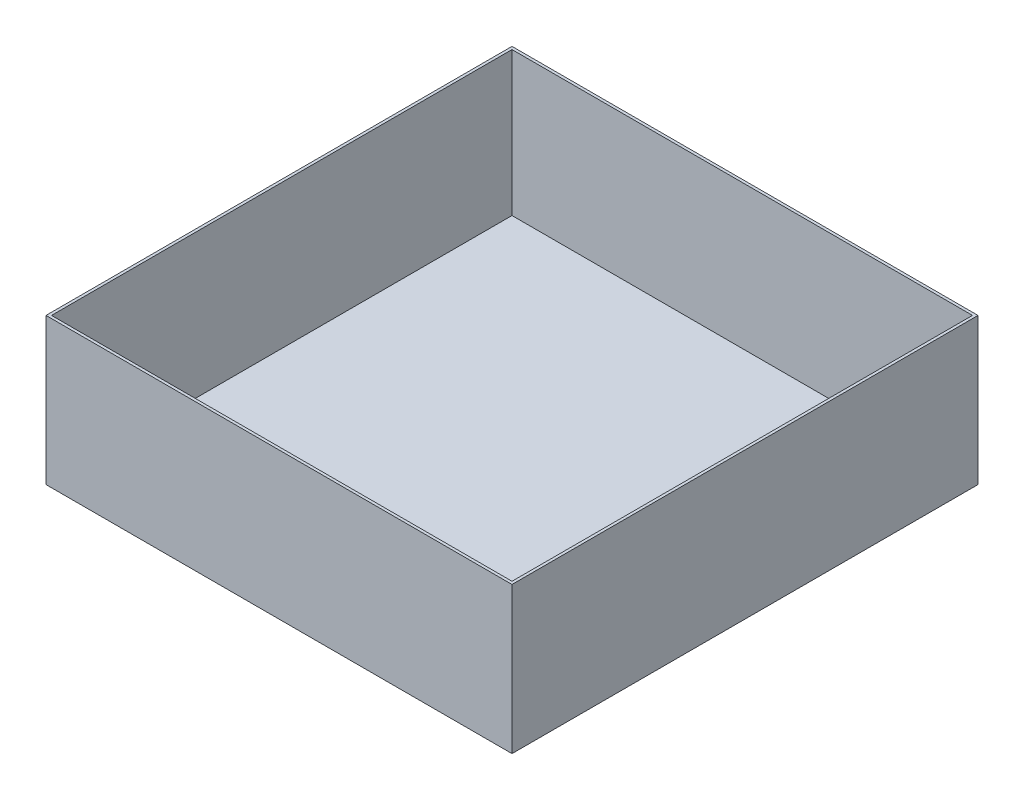
ISO-10303-21;
HEADER;
FILE_DESCRIPTION(('STEP AP214'),'2;1');
FILE_NAME('part.step','',(''),(''),'','','');
FILE_SCHEMA(('AUTOMOTIVE_DESIGN { 1 0 10303 214 1 1 1 1 }'));
ENDSEC;
DATA;
#1=APPLICATION_CONTEXT('core data for automotive mechanical design processes');
#2=APPLICATION_PROTOCOL_DEFINITION('international standard','automotive_design',2000,#1);
#3=PRODUCT_CONTEXT('',#1,'mechanical');
#4=PRODUCT('Part','Part','',(#3));
#5=PRODUCT_RELATED_PRODUCT_CATEGORY('part','',(#4));
#6=PRODUCT_DEFINITION_FORMATION('','',#4);
#7=PRODUCT_DEFINITION_CONTEXT('part definition',#1,'design');
#8=PRODUCT_DEFINITION('design','',#6,#7);
#9=PRODUCT_DEFINITION_SHAPE('','',#8);
#10=(LENGTH_UNIT() NAMED_UNIT(*) SI_UNIT(.MILLI.,.METRE.));
#11=(NAMED_UNIT(*) PLANE_ANGLE_UNIT() SI_UNIT($,.RADIAN.));
#12=(NAMED_UNIT(*) SI_UNIT($,.STERADIAN.) SOLID_ANGLE_UNIT());
#13=UNCERTAINTY_MEASURE_WITH_UNIT(LENGTH_MEASURE(1.E-05),#10,'distance_accuracy_value','');
#14=(GEOMETRIC_REPRESENTATION_CONTEXT(3) GLOBAL_UNCERTAINTY_ASSIGNED_CONTEXT((#13)) GLOBAL_UNIT_ASSIGNED_CONTEXT((#10,
#11,#12)) REPRESENTATION_CONTEXT('',''));
#15=CARTESIAN_POINT('',(0.,0.,0.));
#16=DIRECTION('',(0.,0.,1.));
#17=DIRECTION('',(1.,0.,0.));
#18=AXIS2_PLACEMENT_3D('',#15,#16,#17);
#19=CARTESIAN_POINT('',(0.,10.,0.));
#20=DIRECTION('',(0.,-1.,0.));
#21=DIRECTION('',(0.,0.,-1.));
#22=AXIS2_PLACEMENT_3D('',#19,#20,#21);
#23=PLANE('',#22);
#24=DIRECTION('',(0.,0.,-1.));
#25=VECTOR('',#24,1.);
#26=CARTESIAN_POINT('',(838.2,10.,838.2));
#27=LINE('',#26,#25);
#28=CARTESIAN_POINT('',(838.2,10.,838.2));
#29=VERTEX_POINT('',#28);
#30=CARTESIAN_POINT('',(838.2,10.,-838.2));
#31=VERTEX_POINT('',#30);
#32=EDGE_CURVE('E211',#29,#31,#27,.T.);
#33=ORIENTED_EDGE('',*,*,#32,.T.);
#34=DIRECTION('',(-1.,0.,0.));
#35=VECTOR('',#34,1.);
#36=CARTESIAN_POINT('',(-838.2,10.,-838.2));
#37=LINE('',#36,#35);
#38=CARTESIAN_POINT('',(-838.2,10.,-838.2));
#39=VERTEX_POINT('',#38);
#40=EDGE_CURVE('E91',#31,#39,#37,.T.);
#41=ORIENTED_EDGE('',*,*,#40,.T.);
#42=DIRECTION('',(0.,0.,1.));
#43=VECTOR('',#42,1.);
#44=CARTESIAN_POINT('',(-838.2,10.,838.2));
#45=LINE('',#44,#43);
#46=CARTESIAN_POINT('',(-838.2,10.,838.2));
#47=VERTEX_POINT('',#46);
#48=EDGE_CURVE('E76',#39,#47,#45,.T.);
#49=ORIENTED_EDGE('',*,*,#48,.T.);
#50=DIRECTION('',(1.,0.,0.));
#51=VECTOR('',#50,1.);
#52=CARTESIAN_POINT('',(-838.2,10.,838.2));
#53=LINE('',#52,#51);
#54=EDGE_CURVE('E12',#47,#29,#53,.T.);
#55=ORIENTED_EDGE('',*,*,#54,.T.);
#56=EDGE_LOOP('',(#33,#41,#49,#55));
#57=FACE_BOUND('',#56,.T.);
#58=ADVANCED_FACE('F67',(#57),#23,.F.);
#59=CARTESIAN_POINT('',(838.2,533.4,838.2));
#60=DIRECTION('',(-1.,0.,0.));
#61=DIRECTION('',(0.,0.,1.));
#62=AXIS2_PLACEMENT_3D('',#59,#60,#61);
#63=PLANE('',#62);
#64=ORIENTED_EDGE('',*,*,#32,.F.);
#65=DIRECTION('',(0.,-1.,0.));
#66=VECTOR('',#65,1.);
#67=CARTESIAN_POINT('',(838.2,533.4,838.2));
#68=LINE('',#67,#66);
#69=CARTESIAN_POINT('',(838.2,533.4,838.2));
#70=VERTEX_POINT('',#69);
#71=EDGE_CURVE('E83',#70,#29,#68,.T.);
#72=ORIENTED_EDGE('',*,*,#71,.F.);
#73=DIRECTION('',(0.,0.,-1.));
#74=VECTOR('',#73,1.);
#75=CARTESIAN_POINT('',(838.2,533.4,838.2));
#76=LINE('',#75,#74);
#77=CARTESIAN_POINT('',(838.2,533.4,-838.2));
#78=VERTEX_POINT('',#77);
#79=EDGE_CURVE('E134',#70,#78,#76,.T.);
#80=ORIENTED_EDGE('',*,*,#79,.T.);
#81=DIRECTION('',(0.,-1.,0.));
#82=VECTOR('',#81,1.);
#83=CARTESIAN_POINT('',(838.2,533.4,-838.2));
#84=LINE('',#83,#82);
#85=EDGE_CURVE('E136',#78,#31,#84,.T.);
#86=ORIENTED_EDGE('',*,*,#85,.T.);
#87=EDGE_LOOP('',(#64,#72,#80,#86));
#88=FACE_BOUND('',#87,.T.);
#89=ADVANCED_FACE('F135',(#88),#63,.T.);
#90=CARTESIAN_POINT('',(-838.2,533.4,-838.2));
#91=DIRECTION('',(0.,0.,1.));
#92=DIRECTION('',(1.,0.,0.));
#93=AXIS2_PLACEMENT_3D('',#90,#91,#92);
#94=PLANE('',#93);
#95=ORIENTED_EDGE('',*,*,#40,.F.);
#96=ORIENTED_EDGE('',*,*,#85,.F.);
#97=DIRECTION('',(-1.,0.,0.));
#98=VECTOR('',#97,1.);
#99=CARTESIAN_POINT('',(-838.2,533.4,-838.2));
#100=LINE('',#99,#98);
#101=CARTESIAN_POINT('',(-838.2,533.4,-838.2));
#102=VERTEX_POINT('',#101);
#103=EDGE_CURVE('E142',#78,#102,#100,.T.);
#104=ORIENTED_EDGE('',*,*,#103,.T.);
#105=DIRECTION('',(0.,-1.,0.));
#106=VECTOR('',#105,1.);
#107=CARTESIAN_POINT('',(-838.2,533.4,-838.2));
#108=LINE('',#107,#106);
#109=EDGE_CURVE('E148',#102,#39,#108,.T.);
#110=ORIENTED_EDGE('',*,*,#109,.T.);
#111=EDGE_LOOP('',(#95,#96,#104,#110));
#112=FACE_BOUND('',#111,.T.);
#113=ADVANCED_FACE('F144',(#112),#94,.T.);
#114=CARTESIAN_POINT('',(-838.2,533.4,838.2));
#115=DIRECTION('',(1.,0.,0.));
#116=DIRECTION('',(0.,0.,-1.));
#117=AXIS2_PLACEMENT_3D('',#114,#115,#116);
#118=PLANE('',#117);
#119=ORIENTED_EDGE('',*,*,#48,.F.);
#120=ORIENTED_EDGE('',*,*,#109,.F.);
#121=DIRECTION('',(0.,0.,1.));
#122=VECTOR('',#121,1.);
#123=CARTESIAN_POINT('',(-838.2,533.4,838.2));
#124=LINE('',#123,#122);
#125=CARTESIAN_POINT('',(-838.2,533.4,838.2));
#126=VERTEX_POINT('',#125);
#127=EDGE_CURVE('E153',#102,#126,#124,.T.);
#128=ORIENTED_EDGE('',*,*,#127,.T.);
#129=DIRECTION('',(0.,-1.,0.));
#130=VECTOR('',#129,1.);
#131=CARTESIAN_POINT('',(-838.2,533.4,838.2));
#132=LINE('',#131,#130);
#133=EDGE_CURVE('E164',#126,#47,#132,.T.);
#134=ORIENTED_EDGE('',*,*,#133,.T.);
#135=EDGE_LOOP('',(#119,#120,#128,#134));
#136=FACE_BOUND('',#135,.T.);
#137=ADVANCED_FACE('F219',(#136),#118,.T.);
#138=CARTESIAN_POINT('',(-838.2,533.4,838.2));
#139=DIRECTION('',(0.,0.,-1.));
#140=DIRECTION('',(-1.,0.,0.));
#141=AXIS2_PLACEMENT_3D('',#138,#139,#140);
#142=PLANE('',#141);
#143=ORIENTED_EDGE('',*,*,#54,.F.);
#144=ORIENTED_EDGE('',*,*,#133,.F.);
#145=DIRECTION('',(1.,0.,0.));
#146=VECTOR('',#145,1.);
#147=CARTESIAN_POINT('',(-838.2,533.4,838.2));
#148=LINE('',#147,#146);
#149=EDGE_CURVE('E157',#126,#70,#148,.T.);
#150=ORIENTED_EDGE('',*,*,#149,.T.);
#151=ORIENTED_EDGE('',*,*,#71,.T.);
#152=EDGE_LOOP('',(#143,#144,#150,#151));
#153=FACE_BOUND('',#152,.T.);
#154=ADVANCED_FACE('F220',(#153),#142,.T.);
#155=CARTESIAN_POINT('',(0.,533.4,0.));
#156=DIRECTION('',(0.,1.,0.));
#157=DIRECTION('',(0.,0.,1.));
#158=AXIS2_PLACEMENT_3D('',#155,#156,#157);
#159=PLANE('',#158);
#160=DIRECTION('',(0.,0.,-1.));
#161=VECTOR('',#160,1.);
#162=CARTESIAN_POINT('',(848.2,533.4,0.));
#163=LINE('',#162,#161);
#164=CARTESIAN_POINT('',(848.2,533.4,848.2));
#165=VERTEX_POINT('',#164);
#166=CARTESIAN_POINT('',(848.2,533.4,-848.2));
#167=VERTEX_POINT('',#166);
#168=EDGE_CURVE('E170',#165,#167,#163,.T.);
#169=ORIENTED_EDGE('',*,*,#168,.T.);
#170=DIRECTION('',(-1.,0.,0.));
#171=VECTOR('',#170,1.);
#172=CARTESIAN_POINT('',(0.,533.4,-848.2));
#173=LINE('',#172,#171);
#174=CARTESIAN_POINT('',(-848.2,533.4,-848.2));
#175=VERTEX_POINT('',#174);
#176=EDGE_CURVE('E174',#167,#175,#173,.T.);
#177=ORIENTED_EDGE('',*,*,#176,.T.);
#178=DIRECTION('',(0.,0.,1.));
#179=VECTOR('',#178,1.);
#180=CARTESIAN_POINT('',(-848.2,533.4,0.));
#181=LINE('',#180,#179);
#182=CARTESIAN_POINT('',(-848.2,533.4,848.2));
#183=VERTEX_POINT('',#182);
#184=EDGE_CURVE('E178',#175,#183,#181,.T.);
#185=ORIENTED_EDGE('',*,*,#184,.T.);
#186=DIRECTION('',(1.,0.,0.));
#187=VECTOR('',#186,1.);
#188=CARTESIAN_POINT('',(0.,533.4,848.2));
#189=LINE('',#188,#187);
#190=EDGE_CURVE('E181',#183,#165,#189,.T.);
#191=ORIENTED_EDGE('',*,*,#190,.T.);
#192=EDGE_LOOP('',(#169,#177,#185,#191));
#193=FACE_BOUND('',#192,.T.);
#194=ORIENTED_EDGE('',*,*,#103,.F.);
#195=ORIENTED_EDGE('',*,*,#79,.F.);
#196=ORIENTED_EDGE('',*,*,#149,.F.);
#197=ORIENTED_EDGE('',*,*,#127,.F.);
#198=EDGE_LOOP('',(#194,#195,#196,#197));
#199=FACE_BOUND('',#198,.T.);
#200=ADVANCED_FACE('F151',(#193,#199),#159,.T.);
#201=CARTESIAN_POINT('',(848.2,533.4,0.));
#202=DIRECTION('',(-1.,0.,0.));
#203=DIRECTION('',(0.,0.,1.));
#204=AXIS2_PLACEMENT_3D('',#201,#202,#203);
#205=PLANE('',#204);
#206=DIRECTION('',(0.,0.,-1.));
#207=VECTOR('',#206,1.);
#208=CARTESIAN_POINT('',(848.2,0.,0.));
#209=LINE('',#208,#207);
#210=CARTESIAN_POINT('',(848.2,0.,848.2));
#211=VERTEX_POINT('',#210);
#212=CARTESIAN_POINT('',(848.2,0.,-848.2));
#213=VERTEX_POINT('',#212);
#214=EDGE_CURVE('E147',#211,#213,#209,.T.);
#215=ORIENTED_EDGE('',*,*,#214,.T.);
#216=DIRECTION('',(0.,-1.,0.));
#217=VECTOR('',#216,1.);
#218=CARTESIAN_POINT('',(848.2,533.4,-848.2));
#219=LINE('',#218,#217);
#220=EDGE_CURVE('E207',#167,#213,#219,.T.);
#221=ORIENTED_EDGE('',*,*,#220,.F.);
#222=ORIENTED_EDGE('',*,*,#168,.F.);
#223=DIRECTION('',(0.,-1.,0.));
#224=VECTOR('',#223,1.);
#225=CARTESIAN_POINT('',(848.2,533.4,848.2));
#226=LINE('',#225,#224);
#227=EDGE_CURVE('E184',#165,#211,#226,.T.);
#228=ORIENTED_EDGE('',*,*,#227,.T.);
#229=EDGE_LOOP('',(#215,#221,#222,#228));
#230=FACE_BOUND('',#229,.T.);
#231=ADVANCED_FACE('F227',(#230),#205,.F.);
#232=CARTESIAN_POINT('',(0.,533.4,-848.2));
#233=DIRECTION('',(0.,0.,1.));
#234=DIRECTION('',(1.,0.,0.));
#235=AXIS2_PLACEMENT_3D('',#232,#233,#234);
#236=PLANE('',#235);
#237=DIRECTION('',(-1.,0.,0.));
#238=VECTOR('',#237,1.);
#239=CARTESIAN_POINT('',(0.,0.,-848.2));
#240=LINE('',#239,#238);
#241=CARTESIAN_POINT('',(-848.2,0.,-848.2));
#242=VERTEX_POINT('',#241);
#243=EDGE_CURVE('E188',#213,#242,#240,.T.);
#244=ORIENTED_EDGE('',*,*,#243,.T.);
#245=DIRECTION('',(0.,-1.,0.));
#246=VECTOR('',#245,1.);
#247=CARTESIAN_POINT('',(-848.2,533.4,-848.2));
#248=LINE('',#247,#246);
#249=EDGE_CURVE('E203',#175,#242,#248,.T.);
#250=ORIENTED_EDGE('',*,*,#249,.F.);
#251=ORIENTED_EDGE('',*,*,#176,.F.);
#252=ORIENTED_EDGE('',*,*,#220,.T.);
#253=EDGE_LOOP('',(#244,#250,#251,#252));
#254=FACE_BOUND('',#253,.T.);
#255=ADVANCED_FACE('F239',(#254),#236,.F.);
#256=CARTESIAN_POINT('',(-848.2,533.4,0.));
#257=DIRECTION('',(1.,0.,0.));
#258=DIRECTION('',(0.,0.,-1.));
#259=AXIS2_PLACEMENT_3D('',#256,#257,#258);
#260=PLANE('',#259);
#261=DIRECTION('',(0.,0.,1.));
#262=VECTOR('',#261,1.);
#263=CARTESIAN_POINT('',(-848.2,0.,0.));
#264=LINE('',#263,#262);
#265=CARTESIAN_POINT('',(-848.2,0.,848.2));
#266=VERTEX_POINT('',#265);
#267=EDGE_CURVE('E191',#242,#266,#264,.T.);
#268=ORIENTED_EDGE('',*,*,#267,.T.);
#269=DIRECTION('',(0.,-1.,0.));
#270=VECTOR('',#269,1.);
#271=CARTESIAN_POINT('',(-848.2,533.4,848.2));
#272=LINE('',#271,#270);
#273=EDGE_CURVE('E199',#183,#266,#272,.T.);
#274=ORIENTED_EDGE('',*,*,#273,.F.);
#275=ORIENTED_EDGE('',*,*,#184,.F.);
#276=ORIENTED_EDGE('',*,*,#249,.T.);
#277=EDGE_LOOP('',(#268,#274,#275,#276));
#278=FACE_BOUND('',#277,.T.);
#279=ADVANCED_FACE('F243',(#278),#260,.F.);
#280=CARTESIAN_POINT('',(0.,533.4,848.2));
#281=DIRECTION('',(0.,0.,-1.));
#282=DIRECTION('',(-1.,0.,0.));
#283=AXIS2_PLACEMENT_3D('',#280,#281,#282);
#284=PLANE('',#283);
#285=DIRECTION('',(1.,0.,0.));
#286=VECTOR('',#285,1.);
#287=CARTESIAN_POINT('',(0.,0.,848.2));
#288=LINE('',#287,#286);
#289=EDGE_CURVE('E175',#266,#211,#288,.T.);
#290=ORIENTED_EDGE('',*,*,#289,.T.);
#291=ORIENTED_EDGE('',*,*,#227,.F.);
#292=ORIENTED_EDGE('',*,*,#190,.F.);
#293=ORIENTED_EDGE('',*,*,#273,.T.);
#294=EDGE_LOOP('',(#290,#291,#292,#293));
#295=FACE_BOUND('',#294,.T.);
#296=ADVANCED_FACE('F247',(#295),#284,.F.);
#297=CARTESIAN_POINT('',(0.,0.,0.));
#298=DIRECTION('',(0.,-1.,0.));
#299=DIRECTION('',(0.,0.,-1.));
#300=AXIS2_PLACEMENT_3D('',#297,#298,#299);
#301=PLANE('',#300);
#302=ORIENTED_EDGE('',*,*,#214,.F.);
#303=ORIENTED_EDGE('',*,*,#289,.F.);
#304=ORIENTED_EDGE('',*,*,#267,.F.);
#305=ORIENTED_EDGE('',*,*,#243,.F.);
#306=EDGE_LOOP('',(#302,#303,#304,#305));
#307=FACE_BOUND('',#306,.T.);
#308=ADVANCED_FACE('F69',(#307),#301,.T.);
#309=CLOSED_SHELL('',(#58,#89,#113,#137,#154,#200,#231,#255,#279,#296,#308));
#310=MANIFOLD_SOLID_BREP('B2',#309);
#311=ADVANCED_BREP_SHAPE_REPRESENTATION('',(#18,#310),#14);
#312=SHAPE_DEFINITION_REPRESENTATION(#9,#311);
ENDSEC;
END-ISO-10303-21;
